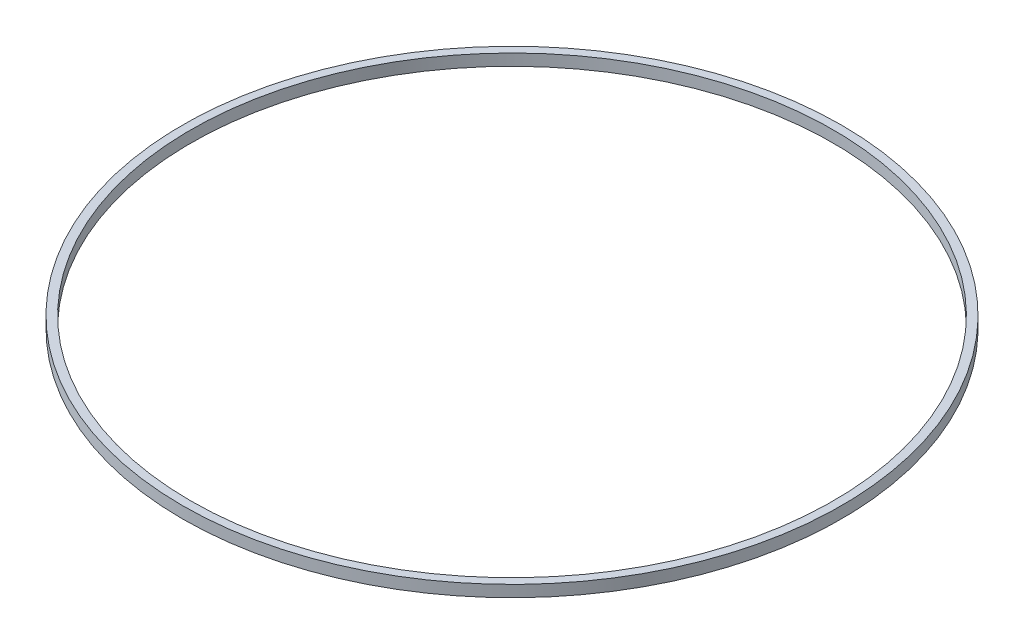
ISO-10303-21;
HEADER;
FILE_DESCRIPTION(('STEP AP214'),'2;1');
FILE_NAME('part.step','',(''),(''),'','','');
FILE_SCHEMA(('AUTOMOTIVE_DESIGN { 1 0 10303 214 1 1 1 1 }'));
ENDSEC;
DATA;
#1=APPLICATION_CONTEXT('core data for automotive mechanical design processes');
#2=APPLICATION_PROTOCOL_DEFINITION('international standard','automotive_design',2000,#1);
#3=PRODUCT_CONTEXT('',#1,'mechanical');
#4=PRODUCT('Part','Part','',(#3));
#5=PRODUCT_RELATED_PRODUCT_CATEGORY('part','',(#4));
#6=PRODUCT_DEFINITION_FORMATION('','',#4);
#7=PRODUCT_DEFINITION_CONTEXT('part definition',#1,'design');
#8=PRODUCT_DEFINITION('design','',#6,#7);
#9=PRODUCT_DEFINITION_SHAPE('','',#8);
#10=(LENGTH_UNIT() NAMED_UNIT(*) SI_UNIT(.MILLI.,.METRE.));
#11=(NAMED_UNIT(*) PLANE_ANGLE_UNIT() SI_UNIT($,.RADIAN.));
#12=(NAMED_UNIT(*) SI_UNIT($,.STERADIAN.) SOLID_ANGLE_UNIT());
#13=UNCERTAINTY_MEASURE_WITH_UNIT(LENGTH_MEASURE(1.E-05),#10,'distance_accuracy_value','');
#14=(GEOMETRIC_REPRESENTATION_CONTEXT(3) GLOBAL_UNCERTAINTY_ASSIGNED_CONTEXT((#13)) GLOBAL_UNIT_ASSIGNED_CONTEXT((#10,
#11,#12)) REPRESENTATION_CONTEXT('',''));
#15=CARTESIAN_POINT('',(0.,0.,0.));
#16=DIRECTION('',(0.,0.,1.));
#17=DIRECTION('',(1.,0.,0.));
#18=AXIS2_PLACEMENT_3D('',#15,#16,#17);
#19=CARTESIAN_POINT('',(0.,3.5,0.));
#20=DIRECTION('',(0.,1.,0.));
#21=DIRECTION('',(0.,0.,1.));
#22=AXIS2_PLACEMENT_3D('',#19,#20,#21);
#23=PLANE('',#22);
#24=CARTESIAN_POINT('',(0.,3.5,0.));
#25=DIRECTION('',(0.,1.,0.));
#26=DIRECTION('',(0.,0.,1.));
#27=AXIS2_PLACEMENT_3D('',#24,#25,#26);
#28=CIRCLE('',#27,100.);
#29=CARTESIAN_POINT('',(0.,3.5,100.));
#30=VERTEX_POINT('',#29);
#31=EDGE_CURVE('E10',#30,#30,#28,.T.);
#32=ORIENTED_EDGE('',*,*,#31,.T.);
#33=EDGE_LOOP('',(#32));
#34=FACE_BOUND('',#33,.T.);
#35=CARTESIAN_POINT('',(0.,3.5,0.));
#36=DIRECTION('',(0.,1.,0.));
#37=DIRECTION('',(0.,0.,1.));
#38=AXIS2_PLACEMENT_3D('',#35,#36,#37);
#39=CIRCLE('',#38,97.5);
#40=CARTESIAN_POINT('',(0.,3.5,97.5));
#41=VERTEX_POINT('',#40);
#42=EDGE_CURVE('E42',#41,#41,#39,.T.);
#43=ORIENTED_EDGE('',*,*,#42,.F.);
#44=EDGE_LOOP('',(#43));
#45=FACE_BOUND('',#44,.T.);
#46=ADVANCED_FACE('F31',(#34,#45),#23,.T.);
#47=CARTESIAN_POINT('',(0.,0.,0.));
#48=DIRECTION('',(0.,1.,0.));
#49=DIRECTION('',(0.,0.,1.));
#50=AXIS2_PLACEMENT_3D('',#47,#48,#49);
#51=PLANE('',#50);
#52=CARTESIAN_POINT('',(0.,0.,0.));
#53=DIRECTION('',(0.,1.,0.));
#54=DIRECTION('',(0.,0.,1.));
#55=AXIS2_PLACEMENT_3D('',#52,#53,#54);
#56=CIRCLE('',#55,100.);
#57=CARTESIAN_POINT('',(0.,0.,100.));
#58=VERTEX_POINT('',#57);
#59=EDGE_CURVE('E35',#58,#58,#56,.T.);
#60=ORIENTED_EDGE('',*,*,#59,.F.);
#61=EDGE_LOOP('',(#60));
#62=FACE_BOUND('',#61,.T.);
#63=CARTESIAN_POINT('',(0.,0.,0.));
#64=DIRECTION('',(0.,1.,0.));
#65=DIRECTION('',(0.,0.,1.));
#66=AXIS2_PLACEMENT_3D('',#63,#64,#65);
#67=CIRCLE('',#66,97.5);
#68=CARTESIAN_POINT('',(0.,0.,97.5));
#69=VERTEX_POINT('',#68);
#70=EDGE_CURVE('E44',#69,#69,#67,.T.);
#71=ORIENTED_EDGE('',*,*,#70,.T.);
#72=EDGE_LOOP('',(#71));
#73=FACE_BOUND('',#72,.T.);
#74=ADVANCED_FACE('F54',(#62,#73),#51,.F.);
#75=CARTESIAN_POINT('',(0.,3.5,0.));
#76=DIRECTION('',(0.,-1.,0.));
#77=DIRECTION('',(0.,0.,-1.));
#78=AXIS2_PLACEMENT_3D('',#75,#76,#77);
#79=CYLINDRICAL_SURFACE('',#78,100.);
#80=ORIENTED_EDGE('',*,*,#31,.F.);
#81=EDGE_LOOP('',(#80));
#82=FACE_BOUND('',#81,.T.);
#83=ORIENTED_EDGE('',*,*,#59,.T.);
#84=EDGE_LOOP('',(#83));
#85=FACE_BOUND('',#84,.T.);
#86=ADVANCED_FACE('F33',(#82,#85),#79,.T.);
#87=CARTESIAN_POINT('',(0.,3.5,0.));
#88=DIRECTION('',(0.,-1.,0.));
#89=DIRECTION('',(0.,0.,-1.));
#90=AXIS2_PLACEMENT_3D('',#87,#88,#89);
#91=CYLINDRICAL_SURFACE('',#90,97.5);
#92=ORIENTED_EDGE('',*,*,#42,.T.);
#93=EDGE_LOOP('',(#92));
#94=FACE_BOUND('',#93,.T.);
#95=ORIENTED_EDGE('',*,*,#70,.F.);
#96=EDGE_LOOP('',(#95));
#97=FACE_BOUND('',#96,.T.);
#98=ADVANCED_FACE('F50',(#94,#97),#91,.F.);
#99=CLOSED_SHELL('',(#46,#74,#86,#98));
#100=MANIFOLD_SOLID_BREP('B2',#99);
#101=ADVANCED_BREP_SHAPE_REPRESENTATION('',(#18,#100),#14);
#102=SHAPE_DEFINITION_REPRESENTATION(#9,#101);
ENDSEC;
END-ISO-10303-21;
